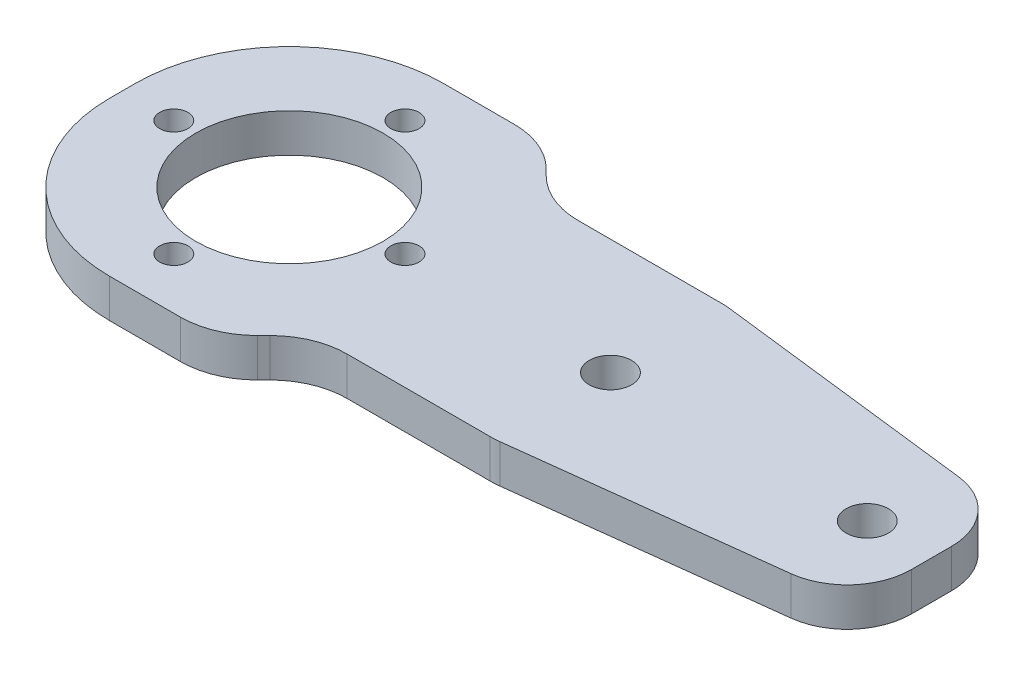
ISO-10303-21;
HEADER;
FILE_DESCRIPTION(('STEP AP214'),'2;1');
FILE_NAME('part.step','',(''),(''),'','','');
FILE_SCHEMA(('AUTOMOTIVE_DESIGN { 1 0 10303 214 1 1 1 1 }'));
ENDSEC;
DATA;
#1=APPLICATION_CONTEXT('core data for automotive mechanical design processes');
#2=APPLICATION_PROTOCOL_DEFINITION('international standard','automotive_design',2000,#1);
#3=PRODUCT_CONTEXT('',#1,'mechanical');
#4=PRODUCT('Part','Part','',(#3));
#5=PRODUCT_RELATED_PRODUCT_CATEGORY('part','',(#4));
#6=PRODUCT_DEFINITION_FORMATION('','',#4);
#7=PRODUCT_DEFINITION_CONTEXT('part definition',#1,'design');
#8=PRODUCT_DEFINITION('design','',#6,#7);
#9=PRODUCT_DEFINITION_SHAPE('','',#8);
#10=(LENGTH_UNIT() NAMED_UNIT(*) SI_UNIT(.MILLI.,.METRE.));
#11=(NAMED_UNIT(*) PLANE_ANGLE_UNIT() SI_UNIT($,.RADIAN.));
#12=(NAMED_UNIT(*) SI_UNIT($,.STERADIAN.) SOLID_ANGLE_UNIT());
#13=UNCERTAINTY_MEASURE_WITH_UNIT(LENGTH_MEASURE(1.E-05),#10,'distance_accuracy_value','');
#14=(GEOMETRIC_REPRESENTATION_CONTEXT(3) GLOBAL_UNCERTAINTY_ASSIGNED_CONTEXT((#13)) GLOBAL_UNIT_ASSIGNED_CONTEXT((#10,
#11,#12)) REPRESENTATION_CONTEXT('',''));
#15=CARTESIAN_POINT('',(0.,0.,0.));
#16=DIRECTION('',(0.,0.,1.));
#17=DIRECTION('',(1.,0.,0.));
#18=AXIS2_PLACEMENT_3D('',#15,#16,#17);
#19=CARTESIAN_POINT('',(0.,3.,0.));
#20=DIRECTION('',(0.,-1.,0.));
#21=DIRECTION('',(0.,0.,-1.));
#22=AXIS2_PLACEMENT_3D('',#19,#20,#21);
#23=PLANE('',#22);
#24=CARTESIAN_POINT('',(22.,3.,-13.));
#25=DIRECTION('',(0.,1.,0.));
#26=DIRECTION('',(0.,0.,1.));
#27=AXIS2_PLACEMENT_3D('',#24,#25,#26);
#28=CIRCLE('',#27,1.1);
#29=CARTESIAN_POINT('',(22.,3.,-11.9));
#30=VERTEX_POINT('',#29);
#31=EDGE_CURVE('E298',#30,#30,#28,.T.);
#32=ORIENTED_EDGE('',*,*,#31,.F.);
#33=EDGE_LOOP('',(#32));
#34=FACE_BOUND('',#33,.T.);
#35=CARTESIAN_POINT('',(13.,3.,-4.));
#36=DIRECTION('',(0.,1.,0.));
#37=DIRECTION('',(0.,0.,1.));
#38=AXIS2_PLACEMENT_3D('',#35,#36,#37);
#39=CIRCLE('',#38,1.1);
#40=CARTESIAN_POINT('',(13.,3.,-2.9));
#41=VERTEX_POINT('',#40);
#42=EDGE_CURVE('E757',#41,#41,#39,.T.);
#43=ORIENTED_EDGE('',*,*,#42,.F.);
#44=EDGE_LOOP('',(#43));
#45=FACE_BOUND('',#44,.T.);
#46=CARTESIAN_POINT('',(4.,3.,-13.0000000000001));
#47=DIRECTION('',(0.,1.,0.));
#48=DIRECTION('',(0.,0.,1.));
#49=AXIS2_PLACEMENT_3D('',#46,#47,#48);
#50=CIRCLE('',#49,1.1);
#51=CARTESIAN_POINT('',(4.,3.,-11.9000000000001));
#52=VERTEX_POINT('',#51);
#53=EDGE_CURVE('E760',#52,#52,#50,.T.);
#54=ORIENTED_EDGE('',*,*,#53,.F.);
#55=EDGE_LOOP('',(#54));
#56=FACE_BOUND('',#55,.T.);
#57=CARTESIAN_POINT('',(13.0000000000001,3.,-22.));
#58=DIRECTION('',(0.,1.,0.));
#59=DIRECTION('',(0.,0.,1.));
#60=AXIS2_PLACEMENT_3D('',#57,#58,#59);
#61=CIRCLE('',#60,1.1);
#62=CARTESIAN_POINT('',(13.0000000000001,3.,-20.9));
#63=VERTEX_POINT('',#62);
#64=EDGE_CURVE('E764',#63,#63,#61,.T.);
#65=ORIENTED_EDGE('',*,*,#64,.F.);
#66=EDGE_LOOP('',(#65));
#67=FACE_BOUND('',#66,.T.);
#68=DIRECTION('',(0.992876838486922,0.,-0.119145220618431));
#69=VECTOR('',#68,1.);
#70=CARTESIAN_POINT('',(38.,3.,-4.));
#71=LINE('',#70,#69);
#72=CARTESIAN_POINT('',(38.3561580756539,3.,-4.04273896907847));
#73=VERTEX_POINT('',#72);
#74=CARTESIAN_POINT('',(58.5957261030921,3.,-6.47148713237106));
#75=VERTEX_POINT('',#74);
#76=EDGE_CURVE('E335',#73,#75,#71,.T.);
#77=ORIENTED_EDGE('',*,*,#76,.T.);
#78=CARTESIAN_POINT('',(58.,3.,-11.4358713248057));
#79=DIRECTION('',(0.,-1.,0.));
#80=DIRECTION('',(0.,0.,-1.));
#81=AXIS2_PLACEMENT_3D('',#78,#79,#80);
#82=CIRCLE('',#81,5.);
#83=CARTESIAN_POINT('',(63.,3.,-11.4358713248057));
#84=VERTEX_POINT('',#83);
#85=EDGE_CURVE('E46',#75,#84,#82,.F.);
#86=ORIENTED_EDGE('',*,*,#85,.T.);
#87=DIRECTION('',(0.,0.,-1.));
#88=VECTOR('',#87,1.);
#89=CARTESIAN_POINT('',(63.,3.,-19.));
#90=LINE('',#89,#88);
#91=CARTESIAN_POINT('',(63.,3.,-14.5641286751943));
#92=VERTEX_POINT('',#91);
#93=EDGE_CURVE('E337',#84,#92,#90,.T.);
#94=ORIENTED_EDGE('',*,*,#93,.T.);
#95=CARTESIAN_POINT('',(58.,3.,-14.5641286751943));
#96=DIRECTION('',(0.,-1.,0.));
#97=DIRECTION('',(0.,0.,-1.));
#98=AXIS2_PLACEMENT_3D('',#95,#96,#97);
#99=CIRCLE('',#98,5.);
#100=CARTESIAN_POINT('',(58.5957261030922,3.,-19.5285128676289));
#101=VERTEX_POINT('',#100);
#102=EDGE_CURVE('E54',#92,#101,#99,.F.);
#103=ORIENTED_EDGE('',*,*,#102,.T.);
#104=DIRECTION('',(-0.992876838486922,0.,-0.11914522061843));
#105=VECTOR('',#104,1.);
#106=CARTESIAN_POINT('',(38.,3.,-22.));
#107=LINE('',#106,#105);
#108=CARTESIAN_POINT('',(38.3561580756539,3.,-21.9572610309215));
#109=VERTEX_POINT('',#108);
#110=EDGE_CURVE('E339',#101,#109,#107,.T.);
#111=ORIENTED_EDGE('',*,*,#110,.T.);
#112=CARTESIAN_POINT('',(37.6412867519433,3.,-16.));
#113=DIRECTION('',(0.,-1.,0.));
#114=DIRECTION('',(0.,0.,-1.));
#115=AXIS2_PLACEMENT_3D('',#112,#113,#114);
#116=CIRCLE('',#115,6.);
#117=CARTESIAN_POINT('',(37.6412867519433,3.,-22.));
#118=VERTEX_POINT('',#117);
#119=EDGE_CURVE('E249',#109,#118,#116,.F.);
#120=ORIENTED_EDGE('',*,*,#119,.T.);
#121=DIRECTION('',(-1.,0.,0.));
#122=VECTOR('',#121,1.);
#123=CARTESIAN_POINT('',(24.,3.,-22.));
#124=LINE('',#123,#122);
#125=CARTESIAN_POINT('',(26.4852813742386,3.,-22.));
#126=VERTEX_POINT('',#125);
#127=EDGE_CURVE('E341',#118,#126,#124,.T.);
#128=ORIENTED_EDGE('',*,*,#127,.T.);
#129=CARTESIAN_POINT('',(26.4852813742386,3.,-28.));
#130=DIRECTION('',(0.,-1.,0.));
#131=DIRECTION('',(0.,0.,-1.));
#132=AXIS2_PLACEMENT_3D('',#129,#130,#131);
#133=CIRCLE('',#132,6.);
#134=CARTESIAN_POINT('',(22.2426406871193,3.,-23.7573593128807));
#135=VERTEX_POINT('',#134);
#136=EDGE_CURVE('E280',#126,#135,#133,.T.);
#137=ORIENTED_EDGE('',*,*,#136,.T.);
#138=DIRECTION('',(-0.707106781186548,0.,-0.707106781186548));
#139=VECTOR('',#138,1.);
#140=CARTESIAN_POINT('',(20.,3.,-26.));
#141=LINE('',#140,#139);
#142=CARTESIAN_POINT('',(21.7573593128807,3.,-24.2426406871193));
#143=VERTEX_POINT('',#142);
#144=EDGE_CURVE('E344',#135,#143,#141,.T.);
#145=ORIENTED_EDGE('',*,*,#144,.T.);
#146=CARTESIAN_POINT('',(17.5147186257614,3.,-20.));
#147=DIRECTION('',(0.,-1.,0.));
#148=DIRECTION('',(0.,0.,-1.));
#149=AXIS2_PLACEMENT_3D('',#146,#147,#148);
#150=CIRCLE('',#149,6.);
#151=CARTESIAN_POINT('',(17.5147186257614,3.,-26.));
#152=VERTEX_POINT('',#151);
#153=EDGE_CURVE('E245',#143,#152,#150,.F.);
#154=ORIENTED_EDGE('',*,*,#153,.T.);
#155=DIRECTION('',(-1.,0.,0.));
#156=VECTOR('',#155,1.);
#157=CARTESIAN_POINT('',(0.,3.,-26.));
#158=LINE('',#157,#156);
#159=CARTESIAN_POINT('',(12.,3.,-26.));
#160=VERTEX_POINT('',#159);
#161=EDGE_CURVE('E347',#152,#160,#158,.T.);
#162=ORIENTED_EDGE('',*,*,#161,.T.);
#163=CARTESIAN_POINT('',(12.,3.,-14.));
#164=DIRECTION('',(0.,-1.,0.));
#165=DIRECTION('',(0.,0.,-1.));
#166=AXIS2_PLACEMENT_3D('',#163,#164,#165);
#167=CIRCLE('',#166,12.);
#168=CARTESIAN_POINT('',(0.,3.,-14.));
#169=VERTEX_POINT('',#168);
#170=EDGE_CURVE('E221',#160,#169,#167,.F.);
#171=ORIENTED_EDGE('',*,*,#170,.T.);
#172=DIRECTION('',(0.,0.,1.));
#173=VECTOR('',#172,1.);
#174=CARTESIAN_POINT('',(0.,3.,0.));
#175=LINE('',#174,#173);
#176=CARTESIAN_POINT('',(0.,3.,-12.));
#177=VERTEX_POINT('',#176);
#178=EDGE_CURVE('E199',#169,#177,#175,.T.);
#179=ORIENTED_EDGE('',*,*,#178,.T.);
#180=CARTESIAN_POINT('',(12.,3.,-12.));
#181=DIRECTION('',(0.,-1.,0.));
#182=DIRECTION('',(0.,0.,-1.));
#183=AXIS2_PLACEMENT_3D('',#180,#181,#182);
#184=CIRCLE('',#183,12.);
#185=CARTESIAN_POINT('',(12.,3.,0.));
#186=VERTEX_POINT('',#185);
#187=EDGE_CURVE('E219',#177,#186,#184,.F.);
#188=ORIENTED_EDGE('',*,*,#187,.T.);
#189=DIRECTION('',(1.,0.,0.));
#190=VECTOR('',#189,1.);
#191=CARTESIAN_POINT('',(0.,3.,0.));
#192=LINE('',#191,#190);
#193=CARTESIAN_POINT('',(17.5147186257614,3.,0.));
#194=VERTEX_POINT('',#193);
#195=EDGE_CURVE('E206',#186,#194,#192,.T.);
#196=ORIENTED_EDGE('',*,*,#195,.T.);
#197=CARTESIAN_POINT('',(17.5147186257614,3.,-6.));
#198=DIRECTION('',(0.,-1.,0.));
#199=DIRECTION('',(0.,0.,-1.));
#200=AXIS2_PLACEMENT_3D('',#197,#198,#199);
#201=CIRCLE('',#200,6.);
#202=CARTESIAN_POINT('',(21.7573593128807,3.,-1.75735931288072));
#203=VERTEX_POINT('',#202);
#204=EDGE_CURVE('E243',#194,#203,#201,.F.);
#205=ORIENTED_EDGE('',*,*,#204,.T.);
#206=DIRECTION('',(0.707106781186548,0.,-0.707106781186548));
#207=VECTOR('',#206,1.);
#208=CARTESIAN_POINT('',(20.,3.,0.));
#209=LINE('',#208,#207);
#210=CARTESIAN_POINT('',(22.2426406871193,3.,-2.24264068711929));
#211=VERTEX_POINT('',#210);
#212=EDGE_CURVE('E210',#203,#211,#209,.T.);
#213=ORIENTED_EDGE('',*,*,#212,.T.);
#214=CARTESIAN_POINT('',(26.4852813742386,3.,2.));
#215=DIRECTION('',(0.,-1.,0.));
#216=DIRECTION('',(0.,0.,-1.));
#217=AXIS2_PLACEMENT_3D('',#214,#215,#216);
#218=CIRCLE('',#217,6.);
#219=CARTESIAN_POINT('',(26.4852813742386,3.,-4.));
#220=VERTEX_POINT('',#219);
#221=EDGE_CURVE('E276',#211,#220,#218,.T.);
#222=ORIENTED_EDGE('',*,*,#221,.T.);
#223=DIRECTION('',(1.,0.,0.));
#224=VECTOR('',#223,1.);
#225=CARTESIAN_POINT('',(24.,3.,-4.));
#226=LINE('',#225,#224);
#227=CARTESIAN_POINT('',(37.6412867519433,3.,-4.));
#228=VERTEX_POINT('',#227);
#229=EDGE_CURVE('E332',#220,#228,#226,.T.);
#230=ORIENTED_EDGE('',*,*,#229,.T.);
#231=CARTESIAN_POINT('',(37.6412867519433,3.,-10.));
#232=DIRECTION('',(0.,-1.,0.));
#233=DIRECTION('',(0.,0.,-1.));
#234=AXIS2_PLACEMENT_3D('',#231,#232,#233);
#235=CIRCLE('',#234,6.);
#236=EDGE_CURVE('E247',#228,#73,#235,.F.);
#237=ORIENTED_EDGE('',*,*,#236,.T.);
#238=EDGE_LOOP('',(#77,#86,#94,#103,#111,#120,#128,#137,#145,#154,#162,#171,#179,#188,#196,#205,
#213,#222,#230,#237));
#239=FACE_BOUND('',#238,.T.);
#240=CARTESIAN_POINT('',(13.,3.,-13.));
#241=DIRECTION('',(0.,1.,0.));
#242=DIRECTION('',(0.,0.,1.));
#243=AXIS2_PLACEMENT_3D('',#240,#241,#242);
#244=CIRCLE('',#243,7.3);
#245=CARTESIAN_POINT('',(13.,3.,-5.7));
#246=VERTEX_POINT('',#245);
#247=EDGE_CURVE('E324',#246,#246,#244,.T.);
#248=ORIENTED_EDGE('',*,*,#247,.F.);
#249=EDGE_LOOP('',(#248));
#250=FACE_BOUND('',#249,.T.);
#251=CARTESIAN_POINT('',(38.,3.,-13.));
#252=DIRECTION('',(0.,1.,0.));
#253=DIRECTION('',(0.,0.,1.));
#254=AXIS2_PLACEMENT_3D('',#251,#252,#253);
#255=CIRCLE('',#254,1.65);
#256=CARTESIAN_POINT('',(38.,3.,-11.35));
#257=VERTEX_POINT('',#256);
#258=EDGE_CURVE('E318',#257,#257,#255,.T.);
#259=ORIENTED_EDGE('',*,*,#258,.F.);
#260=EDGE_LOOP('',(#259));
#261=FACE_BOUND('',#260,.T.);
#262=CARTESIAN_POINT('',(58.,3.,-13.));
#263=DIRECTION('',(0.,1.,0.));
#264=DIRECTION('',(0.,0.,1.));
#265=AXIS2_PLACEMENT_3D('',#262,#263,#264);
#266=CIRCLE('',#265,1.65);
#267=CARTESIAN_POINT('',(58.,3.,-11.35));
#268=VERTEX_POINT('',#267);
#269=EDGE_CURVE('E309',#268,#268,#266,.T.);
#270=ORIENTED_EDGE('',*,*,#269,.F.);
#271=EDGE_LOOP('',(#270));
#272=FACE_BOUND('',#271,.T.);
#273=ADVANCED_FACE('F37',(#34,#45,#56,#67,#239,#250,#261,#272),#23,.F.);
#274=CARTESIAN_POINT('',(0.,0.,0.));
#275=DIRECTION('',(0.,-1.,0.));
#276=DIRECTION('',(0.,0.,-1.));
#277=AXIS2_PLACEMENT_3D('',#274,#275,#276);
#278=PLANE('',#277);
#279=CARTESIAN_POINT('',(22.,0.,-13.));
#280=DIRECTION('',(0.,-1.,0.));
#281=DIRECTION('',(0.,0.,-1.));
#282=AXIS2_PLACEMENT_3D('',#279,#280,#281);
#283=CIRCLE('',#282,1.1);
#284=CARTESIAN_POINT('',(22.,0.,-14.1));
#285=VERTEX_POINT('',#284);
#286=EDGE_CURVE('E41',#285,#285,#283,.T.);
#287=ORIENTED_EDGE('',*,*,#286,.F.);
#288=EDGE_LOOP('',(#287));
#289=FACE_BOUND('',#288,.T.);
#290=CARTESIAN_POINT('',(13.,0.,-4.));
#291=DIRECTION('',(0.,-1.,0.));
#292=DIRECTION('',(0.,0.,-1.));
#293=AXIS2_PLACEMENT_3D('',#290,#291,#292);
#294=CIRCLE('',#293,1.1);
#295=CARTESIAN_POINT('',(13.,0.,-5.1));
#296=VERTEX_POINT('',#295);
#297=EDGE_CURVE('E300',#296,#296,#294,.T.);
#298=ORIENTED_EDGE('',*,*,#297,.F.);
#299=EDGE_LOOP('',(#298));
#300=FACE_BOUND('',#299,.T.);
#301=CARTESIAN_POINT('',(4.,0.,-13.0000000000001));
#302=DIRECTION('',(0.,-1.,0.));
#303=DIRECTION('',(0.,0.,-1.));
#304=AXIS2_PLACEMENT_3D('',#301,#302,#303);
#305=CIRCLE('',#304,1.1);
#306=CARTESIAN_POINT('',(4.,0.,-14.1000000000001));
#307=VERTEX_POINT('',#306);
#308=EDGE_CURVE('E297',#307,#307,#305,.T.);
#309=ORIENTED_EDGE('',*,*,#308,.F.);
#310=EDGE_LOOP('',(#309));
#311=FACE_BOUND('',#310,.T.);
#312=CARTESIAN_POINT('',(13.0000000000001,0.,-22.));
#313=DIRECTION('',(0.,-1.,0.));
#314=DIRECTION('',(0.,0.,-1.));
#315=AXIS2_PLACEMENT_3D('',#312,#313,#314);
#316=CIRCLE('',#315,1.1);
#317=CARTESIAN_POINT('',(13.0000000000001,0.,-23.1));
#318=VERTEX_POINT('',#317);
#319=EDGE_CURVE('E294',#318,#318,#316,.T.);
#320=ORIENTED_EDGE('',*,*,#319,.F.);
#321=EDGE_LOOP('',(#320));
#322=FACE_BOUND('',#321,.T.);
#323=CARTESIAN_POINT('',(38.,0.,-13.));
#324=DIRECTION('',(0.,1.,0.));
#325=DIRECTION('',(0.,0.,1.));
#326=AXIS2_PLACEMENT_3D('',#323,#324,#325);
#327=CIRCLE('',#326,1.65);
#328=CARTESIAN_POINT('',(38.,0.,-11.35));
#329=VERTEX_POINT('',#328);
#330=EDGE_CURVE('E314',#329,#329,#327,.T.);
#331=ORIENTED_EDGE('',*,*,#330,.T.);
#332=EDGE_LOOP('',(#331));
#333=FACE_BOUND('',#332,.T.);
#334=DIRECTION('',(0.,0.,-1.));
#335=VECTOR('',#334,1.);
#336=CARTESIAN_POINT('',(63.,0.,-19.));
#337=LINE('',#336,#335);
#338=CARTESIAN_POINT('',(63.,0.,-11.4358713248057));
#339=VERTEX_POINT('',#338);
#340=CARTESIAN_POINT('',(63.,0.,-14.5641286751943));
#341=VERTEX_POINT('',#340);
#342=EDGE_CURVE('E360',#339,#341,#337,.T.);
#343=ORIENTED_EDGE('',*,*,#342,.F.);
#344=CARTESIAN_POINT('',(58.,0.,-11.4358713248057));
#345=DIRECTION('',(0.,-1.,0.));
#346=DIRECTION('',(0.,0.,-1.));
#347=AXIS2_PLACEMENT_3D('',#344,#345,#346);
#348=CIRCLE('',#347,5.);
#349=CARTESIAN_POINT('',(58.5957261030921,0.,-6.47148713237106));
#350=VERTEX_POINT('',#349);
#351=EDGE_CURVE('E289',#339,#350,#348,.T.);
#352=ORIENTED_EDGE('',*,*,#351,.T.);
#353=DIRECTION('',(0.992876838486922,0.,-0.119145220618431));
#354=VECTOR('',#353,1.);
#355=CARTESIAN_POINT('',(38.,0.,-4.));
#356=LINE('',#355,#354);
#357=CARTESIAN_POINT('',(38.3561580756539,0.,-4.04273896907847));
#358=VERTEX_POINT('',#357);
#359=EDGE_CURVE('E358',#358,#350,#356,.T.);
#360=ORIENTED_EDGE('',*,*,#359,.F.);
#361=CARTESIAN_POINT('',(37.6412867519433,0.,-10.));
#362=DIRECTION('',(0.,-1.,0.));
#363=DIRECTION('',(0.,0.,-1.));
#364=AXIS2_PLACEMENT_3D('',#361,#362,#363);
#365=CIRCLE('',#364,6.);
#366=CARTESIAN_POINT('',(37.6412867519433,0.,-4.));
#367=VERTEX_POINT('',#366);
#368=EDGE_CURVE('E235',#358,#367,#365,.T.);
#369=ORIENTED_EDGE('',*,*,#368,.T.);
#370=DIRECTION('',(1.,0.,0.));
#371=VECTOR('',#370,1.);
#372=CARTESIAN_POINT('',(24.,0.,-4.));
#373=LINE('',#372,#371);
#374=CARTESIAN_POINT('',(26.4852813742386,0.,-4.));
#375=VERTEX_POINT('',#374);
#376=EDGE_CURVE('E355',#375,#367,#373,.T.);
#377=ORIENTED_EDGE('',*,*,#376,.F.);
#378=CARTESIAN_POINT('',(26.4852813742386,0.,2.));
#379=DIRECTION('',(0.,-1.,0.));
#380=DIRECTION('',(0.,0.,-1.));
#381=AXIS2_PLACEMENT_3D('',#378,#379,#380);
#382=CIRCLE('',#381,6.);
#383=CARTESIAN_POINT('',(22.2426406871193,0.,-2.24264068711929));
#384=VERTEX_POINT('',#383);
#385=EDGE_CURVE('E274',#375,#384,#382,.F.);
#386=ORIENTED_EDGE('',*,*,#385,.T.);
#387=DIRECTION('',(0.707106781186548,0.,-0.707106781186548));
#388=VECTOR('',#387,1.);
#389=CARTESIAN_POINT('',(20.,0.,0.));
#390=LINE('',#389,#388);
#391=CARTESIAN_POINT('',(21.7573593128807,0.,-1.75735931288072));
#392=VERTEX_POINT('',#391);
#393=EDGE_CURVE('E352',#392,#384,#390,.T.);
#394=ORIENTED_EDGE('',*,*,#393,.F.);
#395=CARTESIAN_POINT('',(17.5147186257614,0.,-6.));
#396=DIRECTION('',(0.,-1.,0.));
#397=DIRECTION('',(0.,0.,-1.));
#398=AXIS2_PLACEMENT_3D('',#395,#396,#397);
#399=CIRCLE('',#398,6.);
#400=CARTESIAN_POINT('',(17.5147186257614,0.,0.));
#401=VERTEX_POINT('',#400);
#402=EDGE_CURVE('E231',#392,#401,#399,.T.);
#403=ORIENTED_EDGE('',*,*,#402,.T.);
#404=DIRECTION('',(1.,0.,0.));
#405=VECTOR('',#404,1.);
#406=CARTESIAN_POINT('',(0.,0.,0.));
#407=LINE('',#406,#405);
#408=CARTESIAN_POINT('',(12.,0.,0.));
#409=VERTEX_POINT('',#408);
#410=EDGE_CURVE('E327',#409,#401,#407,.T.);
#411=ORIENTED_EDGE('',*,*,#410,.F.);
#412=CARTESIAN_POINT('',(12.,0.,-12.));
#413=DIRECTION('',(0.,-1.,0.));
#414=DIRECTION('',(0.,0.,-1.));
#415=AXIS2_PLACEMENT_3D('',#412,#413,#414);
#416=CIRCLE('',#415,12.);
#417=CARTESIAN_POINT('',(0.,0.,-12.));
#418=VERTEX_POINT('',#417);
#419=EDGE_CURVE('E190',#409,#418,#416,.T.);
#420=ORIENTED_EDGE('',*,*,#419,.T.);
#421=DIRECTION('',(0.,0.,1.));
#422=VECTOR('',#421,1.);
#423=CARTESIAN_POINT('',(0.,0.,0.));
#424=LINE('',#423,#422);
#425=CARTESIAN_POINT('',(0.,0.,-14.));
#426=VERTEX_POINT('',#425);
#427=EDGE_CURVE('E196',#426,#418,#424,.T.);
#428=ORIENTED_EDGE('',*,*,#427,.F.);
#429=CARTESIAN_POINT('',(12.,0.,-14.));
#430=DIRECTION('',(0.,-1.,0.));
#431=DIRECTION('',(0.,0.,-1.));
#432=AXIS2_PLACEMENT_3D('',#429,#430,#431);
#433=CIRCLE('',#432,12.);
#434=CARTESIAN_POINT('',(12.,0.,-26.));
#435=VERTEX_POINT('',#434);
#436=EDGE_CURVE('E180',#426,#435,#433,.T.);
#437=ORIENTED_EDGE('',*,*,#436,.T.);
#438=DIRECTION('',(-1.,0.,0.));
#439=VECTOR('',#438,1.);
#440=CARTESIAN_POINT('',(0.,0.,-26.));
#441=LINE('',#440,#439);
#442=CARTESIAN_POINT('',(17.5147186257614,0.,-26.));
#443=VERTEX_POINT('',#442);
#444=EDGE_CURVE('E207',#443,#435,#441,.T.);
#445=ORIENTED_EDGE('',*,*,#444,.F.);
#446=CARTESIAN_POINT('',(17.5147186257614,0.,-20.));
#447=DIRECTION('',(0.,-1.,0.));
#448=DIRECTION('',(0.,0.,-1.));
#449=AXIS2_PLACEMENT_3D('',#446,#447,#448);
#450=CIRCLE('',#449,6.);
#451=CARTESIAN_POINT('',(21.7573593128807,0.,-24.2426406871193));
#452=VERTEX_POINT('',#451);
#453=EDGE_CURVE('E233',#443,#452,#450,.T.);
#454=ORIENTED_EDGE('',*,*,#453,.T.);
#455=DIRECTION('',(-0.707106781186548,0.,-0.707106781186548));
#456=VECTOR('',#455,1.);
#457=CARTESIAN_POINT('',(20.,0.,-26.));
#458=LINE('',#457,#456);
#459=CARTESIAN_POINT('',(22.2426406871193,0.,-23.7573593128807));
#460=VERTEX_POINT('',#459);
#461=EDGE_CURVE('E212',#460,#452,#458,.T.);
#462=ORIENTED_EDGE('',*,*,#461,.F.);
#463=CARTESIAN_POINT('',(26.4852813742386,0.,-28.));
#464=DIRECTION('',(0.,-1.,0.));
#465=DIRECTION('',(0.,0.,-1.));
#466=AXIS2_PLACEMENT_3D('',#463,#464,#465);
#467=CIRCLE('',#466,6.);
#468=CARTESIAN_POINT('',(26.4852813742386,0.,-22.));
#469=VERTEX_POINT('',#468);
#470=EDGE_CURVE('E278',#460,#469,#467,.F.);
#471=ORIENTED_EDGE('',*,*,#470,.T.);
#472=DIRECTION('',(-1.,0.,0.));
#473=VECTOR('',#472,1.);
#474=CARTESIAN_POINT('',(24.,0.,-22.));
#475=LINE('',#474,#473);
#476=CARTESIAN_POINT('',(37.6412867519433,0.,-22.));
#477=VERTEX_POINT('',#476);
#478=EDGE_CURVE('E365',#477,#469,#475,.T.);
#479=ORIENTED_EDGE('',*,*,#478,.F.);
#480=CARTESIAN_POINT('',(37.6412867519433,0.,-16.));
#481=DIRECTION('',(0.,-1.,0.));
#482=DIRECTION('',(0.,0.,-1.));
#483=AXIS2_PLACEMENT_3D('',#480,#481,#482);
#484=CIRCLE('',#483,6.);
#485=CARTESIAN_POINT('',(38.3561580756539,0.,-21.9572610309215));
#486=VERTEX_POINT('',#485);
#487=EDGE_CURVE('E237',#477,#486,#484,.T.);
#488=ORIENTED_EDGE('',*,*,#487,.T.);
#489=DIRECTION('',(-0.992876838486922,0.,-0.11914522061843));
#490=VECTOR('',#489,1.);
#491=CARTESIAN_POINT('',(38.,0.,-22.));
#492=LINE('',#491,#490);
#493=CARTESIAN_POINT('',(58.5957261030922,0.,-19.5285128676289));
#494=VERTEX_POINT('',#493);
#495=EDGE_CURVE('E363',#494,#486,#492,.T.);
#496=ORIENTED_EDGE('',*,*,#495,.F.);
#497=CARTESIAN_POINT('',(58.,0.,-14.5641286751943));
#498=DIRECTION('',(0.,-1.,0.));
#499=DIRECTION('',(0.,0.,-1.));
#500=AXIS2_PLACEMENT_3D('',#497,#498,#499);
#501=CIRCLE('',#500,5.);
#502=EDGE_CURVE('E287',#494,#341,#501,.T.);
#503=ORIENTED_EDGE('',*,*,#502,.T.);
#504=EDGE_LOOP('',(#343,#352,#360,#369,#377,#386,#394,#403,#411,#420,#428,#437,#445,#454,#462,
#471,#479,#488,#496,#503));
#505=FACE_BOUND('',#504,.T.);
#506=CARTESIAN_POINT('',(13.,0.,-13.));
#507=DIRECTION('',(0.,1.,0.));
#508=DIRECTION('',(0.,0.,1.));
#509=AXIS2_PLACEMENT_3D('',#506,#507,#508);
#510=CIRCLE('',#509,7.3);
#511=CARTESIAN_POINT('',(13.,0.,-5.7));
#512=VERTEX_POINT('',#511);
#513=EDGE_CURVE('E321',#512,#512,#510,.T.);
#514=ORIENTED_EDGE('',*,*,#513,.T.);
#515=EDGE_LOOP('',(#514));
#516=FACE_BOUND('',#515,.T.);
#517=CARTESIAN_POINT('',(58.,0.,-13.));
#518=DIRECTION('',(0.,1.,0.));
#519=DIRECTION('',(0.,0.,1.));
#520=AXIS2_PLACEMENT_3D('',#517,#518,#519);
#521=CIRCLE('',#520,1.65);
#522=CARTESIAN_POINT('',(58.,0.,-11.35));
#523=VERTEX_POINT('',#522);
#524=EDGE_CURVE('E305',#523,#523,#521,.T.);
#525=ORIENTED_EDGE('',*,*,#524,.T.);
#526=EDGE_LOOP('',(#525));
#527=FACE_BOUND('',#526,.T.);
#528=ADVANCED_FACE('F203',(#289,#300,#311,#322,#333,#505,#516,#527),#278,.T.);
#529=CARTESIAN_POINT('',(0.,3.,0.));
#530=DIRECTION('',(0.,0.,-1.));
#531=DIRECTION('',(-1.,0.,0.));
#532=AXIS2_PLACEMENT_3D('',#529,#530,#531);
#533=PLANE('',#532);
#534=ORIENTED_EDGE('',*,*,#410,.T.);
#535=DIRECTION('',(0.,-1.,0.));
#536=VECTOR('',#535,1.);
#537=CARTESIAN_POINT('',(17.5147186257614,3.,0.));
#538=LINE('',#537,#536);
#539=EDGE_CURVE('E272',#401,#194,#538,.F.);
#540=ORIENTED_EDGE('',*,*,#539,.T.);
#541=ORIENTED_EDGE('',*,*,#195,.F.);
#542=DIRECTION('',(0.,-1.,0.));
#543=VECTOR('',#542,1.);
#544=CARTESIAN_POINT('',(12.,3.,0.));
#545=LINE('',#544,#543);
#546=EDGE_CURVE('E223',#186,#409,#545,.T.);
#547=ORIENTED_EDGE('',*,*,#546,.T.);
#548=EDGE_LOOP('',(#534,#540,#541,#547));
#549=FACE_BOUND('',#548,.T.);
#550=ADVANCED_FACE('F388',(#549),#533,.F.);
#551=CARTESIAN_POINT('',(20.,3.,0.));
#552=DIRECTION('',(-0.707106781186547,0.,-0.707106781186547));
#553=DIRECTION('',(-0.707106781186548,0.,0.707106781186548));
#554=AXIS2_PLACEMENT_3D('',#551,#552,#553);
#555=PLANE('',#554);
#556=ORIENTED_EDGE('',*,*,#393,.T.);
#557=DIRECTION('',(0.,-1.,0.));
#558=VECTOR('',#557,1.);
#559=CARTESIAN_POINT('',(22.2426406871193,3.,-2.24264068711928));
#560=LINE('',#559,#558);
#561=EDGE_CURVE('E262',#384,#211,#560,.F.);
#562=ORIENTED_EDGE('',*,*,#561,.T.);
#563=ORIENTED_EDGE('',*,*,#212,.F.);
#564=DIRECTION('',(0.,-1.,0.));
#565=VECTOR('',#564,1.);
#566=CARTESIAN_POINT('',(21.7573593128807,3.,-1.75735931288072));
#567=LINE('',#566,#565);
#568=EDGE_CURVE('E259',#203,#392,#567,.T.);
#569=ORIENTED_EDGE('',*,*,#568,.T.);
#570=EDGE_LOOP('',(#556,#562,#563,#569));
#571=FACE_BOUND('',#570,.T.);
#572=ADVANCED_FACE('F397',(#571),#555,.F.);
#573=CARTESIAN_POINT('',(24.,3.,-4.));
#574=DIRECTION('',(0.,0.,-1.));
#575=DIRECTION('',(-1.,0.,0.));
#576=AXIS2_PLACEMENT_3D('',#573,#574,#575);
#577=PLANE('',#576);
#578=ORIENTED_EDGE('',*,*,#376,.T.);
#579=DIRECTION('',(0.,-1.,0.));
#580=VECTOR('',#579,1.);
#581=CARTESIAN_POINT('',(37.6412867519433,3.,-4.));
#582=LINE('',#581,#580);
#583=EDGE_CURVE('E257',#367,#228,#582,.F.);
#584=ORIENTED_EDGE('',*,*,#583,.T.);
#585=ORIENTED_EDGE('',*,*,#229,.F.);
#586=DIRECTION('',(0.,-1.,0.));
#587=VECTOR('',#586,1.);
#588=CARTESIAN_POINT('',(26.4852813742386,0.,-4.));
#589=LINE('',#588,#587);
#590=EDGE_CURVE('E254',#220,#375,#589,.T.);
#591=ORIENTED_EDGE('',*,*,#590,.T.);
#592=EDGE_LOOP('',(#578,#584,#585,#591));
#593=FACE_BOUND('',#592,.T.);
#594=ADVANCED_FACE('F406',(#593),#577,.F.);
#595=CARTESIAN_POINT('',(38.,3.,-4.));
#596=DIRECTION('',(-0.119145220618431,0.,-0.992876838486922));
#597=DIRECTION('',(-0.992876838486922,0.,0.119145220618431));
#598=AXIS2_PLACEMENT_3D('',#595,#596,#597);
#599=PLANE('',#598);
#600=ORIENTED_EDGE('',*,*,#359,.T.);
#601=DIRECTION('',(0.,-1.,0.));
#602=VECTOR('',#601,1.);
#603=CARTESIAN_POINT('',(58.5957261030922,3.,-6.47148713237106));
#604=LINE('',#603,#602);
#605=EDGE_CURVE('E62',#350,#75,#604,.F.);
#606=ORIENTED_EDGE('',*,*,#605,.T.);
#607=ORIENTED_EDGE('',*,*,#76,.F.);
#608=DIRECTION('',(0.,-1.,0.));
#609=VECTOR('',#608,1.);
#610=CARTESIAN_POINT('',(38.3561580756539,3.,-4.04273896907847));
#611=LINE('',#610,#609);
#612=EDGE_CURVE('E251',#73,#358,#611,.T.);
#613=ORIENTED_EDGE('',*,*,#612,.T.);
#614=EDGE_LOOP('',(#600,#606,#607,#613));
#615=FACE_BOUND('',#614,.T.);
#616=ADVANCED_FACE('F413',(#615),#599,.F.);
#617=CARTESIAN_POINT('',(63.,3.,-19.));
#618=DIRECTION('',(-1.,0.,0.));
#619=DIRECTION('',(0.,0.,1.));
#620=AXIS2_PLACEMENT_3D('',#617,#618,#619);
#621=PLANE('',#620);
#622=ORIENTED_EDGE('',*,*,#93,.F.);
#623=DIRECTION('',(0.,-1.,0.));
#624=VECTOR('',#623,1.);
#625=CARTESIAN_POINT('',(63.,3.,-11.4358713248057));
#626=LINE('',#625,#624);
#627=EDGE_CURVE('E284',#84,#339,#626,.T.);
#628=ORIENTED_EDGE('',*,*,#627,.T.);
#629=ORIENTED_EDGE('',*,*,#342,.T.);
#630=DIRECTION('',(0.,-1.,0.));
#631=VECTOR('',#630,1.);
#632=CARTESIAN_POINT('',(63.,3.,-14.5641286751943));
#633=LINE('',#632,#631);
#634=EDGE_CURVE('E282',#341,#92,#633,.F.);
#635=ORIENTED_EDGE('',*,*,#634,.T.);
#636=EDGE_LOOP('',(#622,#628,#629,#635));
#637=FACE_BOUND('',#636,.T.);
#638=ADVANCED_FACE('F420',(#637),#621,.F.);
#639=CARTESIAN_POINT('',(38.,3.,-22.));
#640=DIRECTION('',(-0.11914522061843,0.,0.992876838486922));
#641=DIRECTION('',(0.992876838486922,0.,0.11914522061843));
#642=AXIS2_PLACEMENT_3D('',#639,#640,#641);
#643=PLANE('',#642);
#644=ORIENTED_EDGE('',*,*,#110,.F.);
#645=DIRECTION('',(0.,-1.,0.));
#646=VECTOR('',#645,1.);
#647=CARTESIAN_POINT('',(58.5957261030922,3.,-19.5285128676289));
#648=LINE('',#647,#646);
#649=EDGE_CURVE('E11',#101,#494,#648,.T.);
#650=ORIENTED_EDGE('',*,*,#649,.T.);
#651=ORIENTED_EDGE('',*,*,#495,.T.);
#652=DIRECTION('',(0.,-1.,0.));
#653=VECTOR('',#652,1.);
#654=CARTESIAN_POINT('',(38.3561580756539,3.,-21.9572610309215));
#655=LINE('',#654,#653);
#656=EDGE_CURVE('E240',#486,#109,#655,.F.);
#657=ORIENTED_EDGE('',*,*,#656,.T.);
#658=EDGE_LOOP('',(#644,#650,#651,#657));
#659=FACE_BOUND('',#658,.T.);
#660=ADVANCED_FACE('F426',(#659),#643,.F.);
#661=CARTESIAN_POINT('',(24.,3.,-22.));
#662=DIRECTION('',(0.,0.,1.));
#663=DIRECTION('',(1.,0.,0.));
#664=AXIS2_PLACEMENT_3D('',#661,#662,#663);
#665=PLANE('',#664);
#666=ORIENTED_EDGE('',*,*,#127,.F.);
#667=DIRECTION('',(0.,-1.,0.));
#668=VECTOR('',#667,1.);
#669=CARTESIAN_POINT('',(37.6412867519433,3.,-22.));
#670=LINE('',#669,#668);
#671=EDGE_CURVE('E228',#118,#477,#670,.T.);
#672=ORIENTED_EDGE('',*,*,#671,.T.);
#673=ORIENTED_EDGE('',*,*,#478,.T.);
#674=DIRECTION('',(0.,-1.,0.));
#675=VECTOR('',#674,1.);
#676=CARTESIAN_POINT('',(26.4852813742386,3.,-22.));
#677=LINE('',#676,#675);
#678=EDGE_CURVE('E226',#469,#126,#677,.F.);
#679=ORIENTED_EDGE('',*,*,#678,.T.);
#680=EDGE_LOOP('',(#666,#672,#673,#679));
#681=FACE_BOUND('',#680,.T.);
#682=ADVANCED_FACE('F434',(#681),#665,.F.);
#683=CARTESIAN_POINT('',(20.,3.,-26.));
#684=DIRECTION('',(-0.707106781186547,0.,0.707106781186547));
#685=DIRECTION('',(0.707106781186548,0.,0.707106781186548));
#686=AXIS2_PLACEMENT_3D('',#683,#684,#685);
#687=PLANE('',#686);
#688=ORIENTED_EDGE('',*,*,#144,.F.);
#689=DIRECTION('',(0.,-1.,0.));
#690=VECTOR('',#689,1.);
#691=CARTESIAN_POINT('',(22.2426406871193,0.,-23.7573593128807));
#692=LINE('',#691,#690);
#693=EDGE_CURVE('E266',#135,#460,#692,.T.);
#694=ORIENTED_EDGE('',*,*,#693,.T.);
#695=ORIENTED_EDGE('',*,*,#461,.T.);
#696=DIRECTION('',(0.,-1.,0.));
#697=VECTOR('',#696,1.);
#698=CARTESIAN_POINT('',(21.7573593128807,3.,-24.2426406871193));
#699=LINE('',#698,#697);
#700=EDGE_CURVE('E264',#452,#143,#699,.F.);
#701=ORIENTED_EDGE('',*,*,#700,.T.);
#702=EDGE_LOOP('',(#688,#694,#695,#701));
#703=FACE_BOUND('',#702,.T.);
#704=ADVANCED_FACE('F372',(#703),#687,.F.);
#705=CARTESIAN_POINT('',(0.,3.,-26.));
#706=DIRECTION('',(0.,0.,1.));
#707=DIRECTION('',(1.,0.,0.));
#708=AXIS2_PLACEMENT_3D('',#705,#706,#707);
#709=PLANE('',#708);
#710=ORIENTED_EDGE('',*,*,#161,.F.);
#711=DIRECTION('',(0.,-1.,0.));
#712=VECTOR('',#711,1.);
#713=CARTESIAN_POINT('',(17.5147186257614,3.,-26.));
#714=LINE('',#713,#712);
#715=EDGE_CURVE('E269',#152,#443,#714,.T.);
#716=ORIENTED_EDGE('',*,*,#715,.T.);
#717=ORIENTED_EDGE('',*,*,#444,.T.);
#718=DIRECTION('',(0.,-1.,0.));
#719=VECTOR('',#718,1.);
#720=CARTESIAN_POINT('',(12.,3.,-26.));
#721=LINE('',#720,#719);
#722=EDGE_CURVE('E186',#435,#160,#721,.F.);
#723=ORIENTED_EDGE('',*,*,#722,.T.);
#724=EDGE_LOOP('',(#710,#716,#717,#723));
#725=FACE_BOUND('',#724,.T.);
#726=ADVANCED_FACE('F381',(#725),#709,.F.);
#727=CARTESIAN_POINT('',(0.,3.,0.));
#728=DIRECTION('',(1.,0.,0.));
#729=DIRECTION('',(0.,0.,-1.));
#730=AXIS2_PLACEMENT_3D('',#727,#728,#729);
#731=PLANE('',#730);
#732=ORIENTED_EDGE('',*,*,#178,.F.);
#733=DIRECTION('',(0.,-1.,0.));
#734=VECTOR('',#733,1.);
#735=CARTESIAN_POINT('',(0.,3.,-14.));
#736=LINE('',#735,#734);
#737=EDGE_CURVE('E184',#169,#426,#736,.T.);
#738=ORIENTED_EDGE('',*,*,#737,.T.);
#739=ORIENTED_EDGE('',*,*,#427,.T.);
#740=DIRECTION('',(0.,-1.,0.));
#741=VECTOR('',#740,1.);
#742=CARTESIAN_POINT('',(0.,3.,-12.));
#743=LINE('',#742,#741);
#744=EDGE_CURVE('E200',#418,#177,#743,.F.);
#745=ORIENTED_EDGE('',*,*,#744,.T.);
#746=EDGE_LOOP('',(#732,#738,#739,#745));
#747=FACE_BOUND('',#746,.T.);
#748=ADVANCED_FACE('F195',(#747),#731,.F.);
#749=CARTESIAN_POINT('',(13.,3.,-13.));
#750=DIRECTION('',(0.,-1.,0.));
#751=DIRECTION('',(0.,0.,-1.));
#752=AXIS2_PLACEMENT_3D('',#749,#750,#751);
#753=CYLINDRICAL_SURFACE('',#752,7.3);
#754=ORIENTED_EDGE('',*,*,#247,.T.);
#755=EDGE_LOOP('',(#754));
#756=FACE_BOUND('',#755,.T.);
#757=ORIENTED_EDGE('',*,*,#513,.F.);
#758=EDGE_LOOP('',(#757));
#759=FACE_BOUND('',#758,.T.);
#760=ADVANCED_FACE('F459',(#756,#759),#753,.F.);
#761=CARTESIAN_POINT('',(38.,3.,-13.));
#762=DIRECTION('',(0.,-1.,0.));
#763=DIRECTION('',(0.,0.,-1.));
#764=AXIS2_PLACEMENT_3D('',#761,#762,#763);
#765=CYLINDRICAL_SURFACE('',#764,1.65);
#766=ORIENTED_EDGE('',*,*,#258,.T.);
#767=EDGE_LOOP('',(#766));
#768=FACE_BOUND('',#767,.T.);
#769=ORIENTED_EDGE('',*,*,#330,.F.);
#770=EDGE_LOOP('',(#769));
#771=FACE_BOUND('',#770,.T.);
#772=ADVANCED_FACE('F654',(#768,#771),#765,.F.);
#773=CARTESIAN_POINT('',(58.,3.,-13.));
#774=DIRECTION('',(0.,-1.,0.));
#775=DIRECTION('',(0.,0.,-1.));
#776=AXIS2_PLACEMENT_3D('',#773,#774,#775);
#777=CYLINDRICAL_SURFACE('',#776,1.65);
#778=ORIENTED_EDGE('',*,*,#269,.T.);
#779=EDGE_LOOP('',(#778));
#780=FACE_BOUND('',#779,.T.);
#781=ORIENTED_EDGE('',*,*,#524,.F.);
#782=EDGE_LOOP('',(#781));
#783=FACE_BOUND('',#782,.T.);
#784=ADVANCED_FACE('F484',(#780,#783),#777,.F.);
#785=CARTESIAN_POINT('',(12.,3.,-14.));
#786=DIRECTION('',(0.,-1.,0.));
#787=DIRECTION('',(0.,0.,-1.));
#788=AXIS2_PLACEMENT_3D('',#785,#786,#787);
#789=CYLINDRICAL_SURFACE('',#788,12.);
#790=ORIENTED_EDGE('',*,*,#170,.F.);
#791=ORIENTED_EDGE('',*,*,#722,.F.);
#792=ORIENTED_EDGE('',*,*,#436,.F.);
#793=ORIENTED_EDGE('',*,*,#737,.F.);
#794=EDGE_LOOP('',(#790,#791,#792,#793));
#795=FACE_BOUND('',#794,.T.);
#796=ADVANCED_FACE('F183',(#795),#789,.T.);
#797=CARTESIAN_POINT('',(12.,3.,-12.));
#798=DIRECTION('',(0.,-1.,0.));
#799=DIRECTION('',(0.,0.,-1.));
#800=AXIS2_PLACEMENT_3D('',#797,#798,#799);
#801=CYLINDRICAL_SURFACE('',#800,12.);
#802=ORIENTED_EDGE('',*,*,#187,.F.);
#803=ORIENTED_EDGE('',*,*,#744,.F.);
#804=ORIENTED_EDGE('',*,*,#419,.F.);
#805=ORIENTED_EDGE('',*,*,#546,.F.);
#806=EDGE_LOOP('',(#802,#803,#804,#805));
#807=FACE_BOUND('',#806,.T.);
#808=ADVANCED_FACE('F386',(#807),#801,.T.);
#809=CARTESIAN_POINT('',(37.6412867519433,3.,-16.));
#810=DIRECTION('',(0.,-1.,0.));
#811=DIRECTION('',(0.,0.,-1.));
#812=AXIS2_PLACEMENT_3D('',#809,#810,#811);
#813=CYLINDRICAL_SURFACE('',#812,6.);
#814=ORIENTED_EDGE('',*,*,#119,.F.);
#815=ORIENTED_EDGE('',*,*,#656,.F.);
#816=ORIENTED_EDGE('',*,*,#487,.F.);
#817=ORIENTED_EDGE('',*,*,#671,.F.);
#818=EDGE_LOOP('',(#814,#815,#816,#817));
#819=FACE_BOUND('',#818,.T.);
#820=ADVANCED_FACE('F437',(#819),#813,.T.);
#821=CARTESIAN_POINT('',(37.6412867519433,3.,-10.));
#822=DIRECTION('',(0.,-1.,0.));
#823=DIRECTION('',(0.,0.,-1.));
#824=AXIS2_PLACEMENT_3D('',#821,#822,#823);
#825=CYLINDRICAL_SURFACE('',#824,6.);
#826=ORIENTED_EDGE('',*,*,#236,.F.);
#827=ORIENTED_EDGE('',*,*,#583,.F.);
#828=ORIENTED_EDGE('',*,*,#368,.F.);
#829=ORIENTED_EDGE('',*,*,#612,.F.);
#830=EDGE_LOOP('',(#826,#827,#828,#829));
#831=FACE_BOUND('',#830,.T.);
#832=ADVANCED_FACE('F412',(#831),#825,.T.);
#833=CARTESIAN_POINT('',(26.4852813742386,3.,2.));
#834=DIRECTION('',(0.,1.,0.));
#835=DIRECTION('',(0.,0.,1.));
#836=AXIS2_PLACEMENT_3D('',#833,#834,#835);
#837=CYLINDRICAL_SURFACE('',#836,6.);
#838=ORIENTED_EDGE('',*,*,#221,.F.);
#839=ORIENTED_EDGE('',*,*,#561,.F.);
#840=ORIENTED_EDGE('',*,*,#385,.F.);
#841=ORIENTED_EDGE('',*,*,#590,.F.);
#842=EDGE_LOOP('',(#838,#839,#840,#841));
#843=FACE_BOUND('',#842,.T.);
#844=ADVANCED_FACE('F403',(#843),#837,.F.);
#845=CARTESIAN_POINT('',(26.4852813742386,3.,-28.));
#846=DIRECTION('',(0.,1.,0.));
#847=DIRECTION('',(0.,0.,1.));
#848=AXIS2_PLACEMENT_3D('',#845,#846,#847);
#849=CYLINDRICAL_SURFACE('',#848,6.);
#850=ORIENTED_EDGE('',*,*,#136,.F.);
#851=ORIENTED_EDGE('',*,*,#678,.F.);
#852=ORIENTED_EDGE('',*,*,#470,.F.);
#853=ORIENTED_EDGE('',*,*,#693,.F.);
#854=EDGE_LOOP('',(#850,#851,#852,#853));
#855=FACE_BOUND('',#854,.T.);
#856=ADVANCED_FACE('F439',(#855),#849,.F.);
#857=CARTESIAN_POINT('',(17.5147186257614,3.,-20.));
#858=DIRECTION('',(0.,-1.,0.));
#859=DIRECTION('',(0.,0.,-1.));
#860=AXIS2_PLACEMENT_3D('',#857,#858,#859);
#861=CYLINDRICAL_SURFACE('',#860,6.);
#862=ORIENTED_EDGE('',*,*,#153,.F.);
#863=ORIENTED_EDGE('',*,*,#700,.F.);
#864=ORIENTED_EDGE('',*,*,#453,.F.);
#865=ORIENTED_EDGE('',*,*,#715,.F.);
#866=EDGE_LOOP('',(#862,#863,#864,#865));
#867=FACE_BOUND('',#866,.T.);
#868=ADVANCED_FACE('F376',(#867),#861,.T.);
#869=CARTESIAN_POINT('',(17.5147186257614,3.,-6.));
#870=DIRECTION('',(0.,-1.,0.));
#871=DIRECTION('',(0.,0.,-1.));
#872=AXIS2_PLACEMENT_3D('',#869,#870,#871);
#873=CYLINDRICAL_SURFACE('',#872,6.);
#874=ORIENTED_EDGE('',*,*,#204,.F.);
#875=ORIENTED_EDGE('',*,*,#539,.F.);
#876=ORIENTED_EDGE('',*,*,#402,.F.);
#877=ORIENTED_EDGE('',*,*,#568,.F.);
#878=EDGE_LOOP('',(#874,#875,#876,#877));
#879=FACE_BOUND('',#878,.T.);
#880=ADVANCED_FACE('F394',(#879),#873,.T.);
#881=CARTESIAN_POINT('',(58.,3.,-11.4358713248057));
#882=DIRECTION('',(0.,-1.,0.));
#883=DIRECTION('',(0.,0.,-1.));
#884=AXIS2_PLACEMENT_3D('',#881,#882,#883);
#885=CYLINDRICAL_SURFACE('',#884,5.);
#886=ORIENTED_EDGE('',*,*,#85,.F.);
#887=ORIENTED_EDGE('',*,*,#605,.F.);
#888=ORIENTED_EDGE('',*,*,#351,.F.);
#889=ORIENTED_EDGE('',*,*,#627,.F.);
#890=EDGE_LOOP('',(#886,#887,#888,#889));
#891=FACE_BOUND('',#890,.T.);
#892=ADVANCED_FACE('F418',(#891),#885,.T.);
#893=CARTESIAN_POINT('',(58.,3.,-14.5641286751943));
#894=DIRECTION('',(0.,-1.,0.));
#895=DIRECTION('',(0.,0.,-1.));
#896=AXIS2_PLACEMENT_3D('',#893,#894,#895);
#897=CYLINDRICAL_SURFACE('',#896,5.);
#898=ORIENTED_EDGE('',*,*,#102,.F.);
#899=ORIENTED_EDGE('',*,*,#634,.F.);
#900=ORIENTED_EDGE('',*,*,#502,.F.);
#901=ORIENTED_EDGE('',*,*,#649,.F.);
#902=EDGE_LOOP('',(#898,#899,#900,#901));
#903=FACE_BOUND('',#902,.T.);
#904=ADVANCED_FACE('F39',(#903),#897,.T.);
#905=CARTESIAN_POINT('',(13.0000000000001,-7.,-22.));
#906=DIRECTION('',(0.,1.,0.));
#907=DIRECTION('',(0.,0.,1.));
#908=AXIS2_PLACEMENT_3D('',#905,#906,#907);
#909=CYLINDRICAL_SURFACE('',#908,1.1);
#910=ORIENTED_EDGE('',*,*,#319,.T.);
#911=EDGE_LOOP('',(#910));
#912=FACE_BOUND('',#911,.T.);
#913=ORIENTED_EDGE('',*,*,#64,.T.);
#914=EDGE_LOOP('',(#913));
#915=FACE_BOUND('',#914,.T.);
#916=ADVANCED_FACE('F559',(#912,#915),#909,.F.);
#917=CARTESIAN_POINT('',(4.,-7.,-13.0000000000001));
#918=DIRECTION('',(0.,1.,0.));
#919=DIRECTION('',(0.,0.,1.));
#920=AXIS2_PLACEMENT_3D('',#917,#918,#919);
#921=CYLINDRICAL_SURFACE('',#920,1.1);
#922=ORIENTED_EDGE('',*,*,#308,.T.);
#923=EDGE_LOOP('',(#922));
#924=FACE_BOUND('',#923,.T.);
#925=ORIENTED_EDGE('',*,*,#53,.T.);
#926=EDGE_LOOP('',(#925));
#927=FACE_BOUND('',#926,.T.);
#928=ADVANCED_FACE('F582',(#924,#927),#921,.F.);
#929=CARTESIAN_POINT('',(13.,-7.,-4.));
#930=DIRECTION('',(0.,1.,0.));
#931=DIRECTION('',(0.,0.,1.));
#932=AXIS2_PLACEMENT_3D('',#929,#930,#931);
#933=CYLINDRICAL_SURFACE('',#932,1.1);
#934=ORIENTED_EDGE('',*,*,#297,.T.);
#935=EDGE_LOOP('',(#934));
#936=FACE_BOUND('',#935,.T.);
#937=ORIENTED_EDGE('',*,*,#42,.T.);
#938=EDGE_LOOP('',(#937));
#939=FACE_BOUND('',#938,.T.);
#940=ADVANCED_FACE('F593',(#936,#939),#933,.F.);
#941=CARTESIAN_POINT('',(22.,-7.,-13.));
#942=DIRECTION('',(0.,1.,0.));
#943=DIRECTION('',(0.,0.,1.));
#944=AXIS2_PLACEMENT_3D('',#941,#942,#943);
#945=CYLINDRICAL_SURFACE('',#944,1.1);
#946=ORIENTED_EDGE('',*,*,#286,.T.);
#947=EDGE_LOOP('',(#946));
#948=FACE_BOUND('',#947,.T.);
#949=ORIENTED_EDGE('',*,*,#31,.T.);
#950=EDGE_LOOP('',(#949));
#951=FACE_BOUND('',#950,.T.);
#952=ADVANCED_FACE('F604',(#948,#951),#945,.F.);
#953=CLOSED_SHELL('',(#273,#528,#550,#572,#594,#616,#638,#660,#682,#704,#726,#748,#760,#772,
#784,#796,#808,#820,#832,#844,#856,#868,#880,#892,#904,#916,#928,#940,#952));
#954=MANIFOLD_SOLID_BREP('B2',#953);
#955=ADVANCED_BREP_SHAPE_REPRESENTATION('',(#18,#954),#14);
#956=SHAPE_DEFINITION_REPRESENTATION(#9,#955);
ENDSEC;
END-ISO-10303-21;
